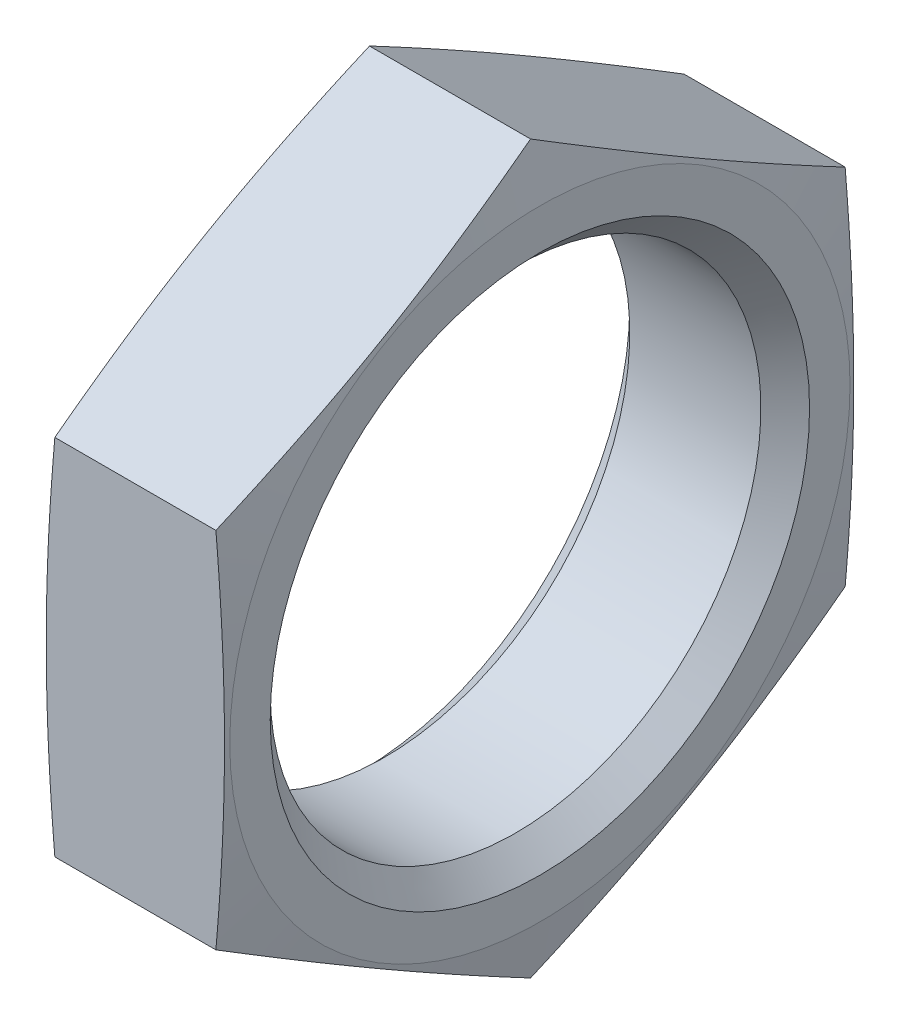
ISO-10303-21;
HEADER;
FILE_DESCRIPTION(('STEP AP214'),'2;1');
FILE_NAME('part.step','',(''),(''),'','','');
FILE_SCHEMA(('AUTOMOTIVE_DESIGN { 1 0 10303 214 1 1 1 1 }'));
ENDSEC;
DATA;
#1=APPLICATION_CONTEXT('core data for automotive mechanical design processes');
#2=APPLICATION_PROTOCOL_DEFINITION('international standard','automotive_design',2000,#1);
#3=PRODUCT_CONTEXT('',#1,'mechanical');
#4=PRODUCT('Part','Part','',(#3));
#5=PRODUCT_RELATED_PRODUCT_CATEGORY('part','',(#4));
#6=PRODUCT_DEFINITION_FORMATION('','',#4);
#7=PRODUCT_DEFINITION_CONTEXT('part definition',#1,'design');
#8=PRODUCT_DEFINITION('design','',#6,#7);
#9=PRODUCT_DEFINITION_SHAPE('','',#8);
#10=(LENGTH_UNIT() NAMED_UNIT(*) SI_UNIT(.MILLI.,.METRE.));
#11=(NAMED_UNIT(*) PLANE_ANGLE_UNIT() SI_UNIT($,.RADIAN.));
#12=(NAMED_UNIT(*) SI_UNIT($,.STERADIAN.) SOLID_ANGLE_UNIT());
#13=UNCERTAINTY_MEASURE_WITH_UNIT(LENGTH_MEASURE(1.E-05),#10,'distance_accuracy_value','');
#14=(GEOMETRIC_REPRESENTATION_CONTEXT(3) GLOBAL_UNCERTAINTY_ASSIGNED_CONTEXT((#13)) GLOBAL_UNIT_ASSIGNED_CONTEXT((#10,
#11,#12)) REPRESENTATION_CONTEXT('',''));
#15=CARTESIAN_POINT('',(0.,0.,0.));
#16=DIRECTION('',(0.,0.,1.));
#17=DIRECTION('',(1.,0.,0.));
#18=AXIS2_PLACEMENT_3D('',#15,#16,#17);
#19=CARTESIAN_POINT('',(0.,0.,0.));
#20=DIRECTION('',(1.,0.,0.));
#21=DIRECTION('',(0.,0.,-1.));
#22=AXIS2_PLACEMENT_3D('',#19,#20,#21);
#23=PLANE('',#22);
#24=CARTESIAN_POINT('',(0.,0.,0.));
#25=DIRECTION('',(-1.,0.,0.));
#26=DIRECTION('',(0.,0.,1.));
#27=AXIS2_PLACEMENT_3D('',#24,#25,#26);
#28=CIRCLE('',#27,6.);
#29=CARTESIAN_POINT('',(0.,0.,6.));
#30=VERTEX_POINT('',#29);
#31=EDGE_CURVE('E227',#30,#30,#28,.T.);
#32=ORIENTED_EDGE('',*,*,#31,.F.);
#33=EDGE_LOOP('',(#32));
#34=FACE_BOUND('',#33,.T.);
#35=CARTESIAN_POINT('',(0.,0.,0.));
#36=DIRECTION('',(-1.,0.,0.));
#37=DIRECTION('',(0.,0.,1.));
#38=AXIS2_PLACEMENT_3D('',#35,#36,#37);
#39=CIRCLE('',#38,6.9);
#40=CARTESIAN_POINT('',(0.,0.,6.9));
#41=VERTEX_POINT('',#40);
#42=EDGE_CURVE('E97',#41,#41,#39,.T.);
#43=ORIENTED_EDGE('',*,*,#42,.T.);
#44=EDGE_LOOP('',(#43));
#45=FACE_BOUND('',#44,.T.);
#46=ADVANCED_FACE('F38',(#34,#45),#23,.F.);
#47=CARTESIAN_POINT('',(0.51134824405455,0.,0.));
#48=DIRECTION('',(1.,0.,0.));
#49=DIRECTION('',(0.,0.,-1.));
#50=AXIS2_PLACEMENT_3D('',#47,#48,#49);
#51=CONICAL_SURFACE('',#50,9.8,1.39626340159546);
#52=CARTESIAN_POINT('',(0.208598210917811,-8.08301923870864,-0.000200000000000218));
#53=CARTESIAN_POINT('',(0.178934031185304,-7.91486089927859,0.291058787609258));
#54=CARTESIAN_POINT('',(0.152040963646026,-7.74656924527423,0.582548482834601));
#55=CARTESIAN_POINT('',(0.104836444466202,-7.40972818516162,1.165974313025));
#56=CARTESIAN_POINT('',(0.084526115902505,-7.24117873999497,1.45791051564118));
#57=CARTESIAN_POINT('',(0.051574332918035,-6.9042670406856,2.04145869650939));
#58=CARTESIAN_POINT('',(0.0389157604930656,-6.73590521607408,2.33306993079153));
#59=CARTESIAN_POINT('',(0.0219452806723447,-6.399088197368,2.91645412004434));
#60=CARTESIAN_POINT('',(0.0176326980708511,-6.23063301192955,3.20822706002217));
#61=CARTESIAN_POINT('',(0.0176326980708505,-5.89372264105265,3.79177293997783));
#62=CARTESIAN_POINT('',(0.0219452806723437,-5.7252674556142,4.08354587995566));
#63=CARTESIAN_POINT('',(0.0389157604930635,-5.38845043690812,4.66693006920846));
#64=CARTESIAN_POINT('',(0.0515743329180324,-5.22008861229661,4.95854130349061));
#65=CARTESIAN_POINT('',(0.0845261159025014,-4.88317691298723,5.54208948435882));
#66=CARTESIAN_POINT('',(0.104836444466198,-4.71462746782058,5.83402568697499));
#67=CARTESIAN_POINT('',(0.152040963646022,-4.37778640770797,6.4174515171654));
#68=CARTESIAN_POINT('',(0.178934031185299,-4.20949475370361,6.70894121239074));
#69=CARTESIAN_POINT('',(0.208598210917806,-4.04133641427356,7.0002));
#70=B_SPLINE_CURVE_WITH_KNOTS('',3,(#52,#53,#54,#55,#56,#57,#58,#59,#60,#61,#62,#63,#64,#65,#66,
#67,#68,#69),.UNSPECIFIED.,.F.,.F.,(4,2,2,2,2,2,2,2,4),(0.,1.01288904335959,2.02595080421072,
3.0367377405632,4.04744289899678,5.05814805743035,6.06893499378283,7.08199675463396,
8.09488579799355),.UNSPECIFIED.);
#71=CARTESIAN_POINT('',(0.208577849995566,-8.0829037686548,0.));
#72=VERTEX_POINT('',#71);
#73=CARTESIAN_POINT('',(0.208577849995561,-4.0414518843274,7.));
#74=VERTEX_POINT('',#73);
#75=EDGE_CURVE('E170',#72,#74,#70,.T.);
#76=ORIENTED_EDGE('',*,*,#75,.T.);
#77=CARTESIAN_POINT('',(1.03573983213423,-10.6852408917921,7.));
#78=CARTESIAN_POINT('',(0.988869445199721,-10.3673821120449,7.));
#79=CARTESIAN_POINT('',(0.942590712560512,-10.0494345856086,7.));
#80=CARTESIAN_POINT('',(0.851529569636411,-9.41331934046108,7.));
#81=CARTESIAN_POINT('',(0.806747188141204,-9.09515161763335,7.));
#82=CARTESIAN_POINT('',(0.718975002789949,-8.45843068087786,7.));
#83=CARTESIAN_POINT('',(0.675985966261113,-8.13987736074993,7.));
#84=CARTESIAN_POINT('',(0.592238427782165,-7.50247830410848,7.));
#85=CARTESIAN_POINT('',(0.551479917391049,-7.1836325687062,7.));
#86=CARTESIAN_POINT('',(0.472840896650842,-6.54666954301501,7.));
#87=CARTESIAN_POINT('',(0.43495118474371,-6.22855340024678,7.));
#88=CARTESIAN_POINT('',(0.362535904606859,-5.5919393220279,7.));
#89=CARTESIAN_POINT('',(0.328010370000629,-5.27344138279355,7.));
#90=CARTESIAN_POINT('',(0.230603111134978,-4.3173393176134,7.));
#91=CARTESIAN_POINT('',(0.173882882293425,-3.6790656290464,7.));
#92=CARTESIAN_POINT('',(0.106454465311887,-2.71889798061668,7.));
#93=CARTESIAN_POINT('',(0.0868952391638139,-2.39762281516337,7.));
#94=CARTESIAN_POINT('',(0.0546612740427168,-1.75472215713288,7.));
#95=CARTESIAN_POINT('',(0.0419864756511023,-1.43309666760329,7.));
#96=CARTESIAN_POINT('',(0.0241993730173904,-0.78969245575697,7.));
#97=CARTESIAN_POINT('',(0.0190856777128923,-0.467913772523749,7.));
#98=CARTESIAN_POINT('',(0.016717486441324,0.175673029012467,7.));
#99=CARTESIAN_POINT('',(0.0194629852335243,0.497481147295691,7.));
#100=CARTESIAN_POINT('',(0.0326600675426673,1.14144143877266,7.));
#101=CARTESIAN_POINT('',(0.0431237365163778,1.4635933594555,7.));
#102=CARTESIAN_POINT('',(0.0711886127627938,2.10758320342819,7.));
#103=CARTESIAN_POINT('',(0.0887898777304164,2.42942112415884,7.));
#104=CARTESIAN_POINT('',(0.130280498071933,3.07276879038696,7.));
#105=CARTESIAN_POINT('',(0.154171471801963,3.39427843001271,7.));
#106=CARTESIAN_POINT('',(0.207294286432592,4.03685079806428,7.));
#107=CARTESIAN_POINT('',(0.236526136299996,4.35791352573886,7.));
#108=CARTESIAN_POINT('',(0.327595241004518,5.28750846153191,7.));
#109=CARTESIAN_POINT('',(0.39515294255256,5.89547787340594,7.));
#110=CARTESIAN_POINT('',(0.540930761742126,7.11013733555543,7.));
#111=CARTESIAN_POINT('',(0.619151529712822,7.7168273055056,7.));
#112=CARTESIAN_POINT('',(0.782777339261565,8.92932590490273,7.));
#113=CARTESIAN_POINT('',(0.868183494686227,9.53513438284301,7.));
#114=CARTESIAN_POINT('',(1.04390039507952,10.7460167156099,7.));
#115=CARTESIAN_POINT('',(1.1342110042419,11.3510905903042,7.));
#116=CARTESIAN_POINT('',(1.31788327190217,12.5581361996854,7.));
#117=CARTESIAN_POINT('',(1.41123029581419,13.16011016982,7.));
#118=CARTESIAN_POINT('',(1.60038983250194,14.3636748668853,7.));
#119=CARTESIAN_POINT('',(1.69620236665469,14.9652655904468,7.));
#120=CARTESIAN_POINT('',(1.88958223615156,16.1677740331663,7.));
#121=CARTESIAN_POINT('',(1.98714842348572,16.7686919373405,7.));
#122=CARTESIAN_POINT('',(2.18367756873341,17.9702896857593,7.));
#123=CARTESIAN_POINT('',(2.28264050449119,18.570969533625,7.));
#124=CARTESIAN_POINT('',(2.38209492105432,19.1715669907708,7.));
#125=B_SPLINE_CURVE_WITH_KNOTS('',3,(#77,#78,#79,#80,#81,#82,#83,#84,#85,#86,#87,#88,#89,#90,
#91,#92,#93,#94,#95,#96,#97,#98,#99,#100,#101,#102,#103,#104,#105,#106,#107,#108,#109,#110,#111,
#112,#113,#114,#115,#116,#117,#118,#119,#120,#121,#122,#123,#124),.UNSPECIFIED.,.F.,.F.,(4,2,2,
2,2,2,2,2,2,2,2,2,2,2,2,2,2,2,2,2,2,2,2,4),(0.,0.963889255163711,1.92779704481883,
2.89211312249182,3.85642555064156,4.81750099011536,5.77858603413482,7.70057071049791,
8.66612092391068,9.63166280365416,10.5970270246378,11.5623906018898,12.5292690062345,
13.4961552262473,14.4632904718063,15.4304273411051,17.2653974812022,19.1004795843035,
20.9358466796179,22.7711629787824,24.5986616976693,26.4261762670786,28.2525351597174,
30.0788651144525),.UNSPECIFIED.);
#126=CARTESIAN_POINT('',(0.208577849995561,4.0414518843274,7.));
#127=VERTEX_POINT('',#126);
#128=EDGE_CURVE('E176',#74,#127,#125,.T.);
#129=ORIENTED_EDGE('',*,*,#128,.T.);
#130=CARTESIAN_POINT('',(0.208598210917806,4.04133641427356,7.0002));
#131=CARTESIAN_POINT('',(0.178934031185299,4.20949475370361,6.70894121239074));
#132=CARTESIAN_POINT('',(0.152040963646022,4.37778640770797,6.4174515171654));
#133=CARTESIAN_POINT('',(0.104836444466198,4.71462746782058,5.834025686975));
#134=CARTESIAN_POINT('',(0.0845261159025015,4.88317691298723,5.54208948435882));
#135=CARTESIAN_POINT('',(0.0515743329180325,5.2200886122966,4.95854130349061));
#136=CARTESIAN_POINT('',(0.0389157604930636,5.38845043690812,4.66693006920847));
#137=CARTESIAN_POINT('',(0.0219452806723438,5.7252674556142,4.08354587995566));
#138=CARTESIAN_POINT('',(0.0176326980708506,5.89372264105265,3.79177293997783));
#139=CARTESIAN_POINT('',(0.0176326980708511,6.23063301192955,3.20822706002217));
#140=CARTESIAN_POINT('',(0.0219452806723447,6.399088197368,2.91645412004434));
#141=CARTESIAN_POINT('',(0.0389157604930655,6.73590521607408,2.33306993079153));
#142=CARTESIAN_POINT('',(0.0515743329180349,6.9042670406856,2.04145869650939));
#143=CARTESIAN_POINT('',(0.0845261159025049,7.24117873999497,1.45791051564118));
#144=CARTESIAN_POINT('',(0.104836444466202,7.40972818516162,1.165974313025));
#145=CARTESIAN_POINT('',(0.152040963646026,7.74656924527423,0.582548482834602));
#146=CARTESIAN_POINT('',(0.178934031185304,7.91486089927859,0.291058787609259));
#147=CARTESIAN_POINT('',(0.208598210917811,8.08301923870864,-0.000199999999999923));
#148=B_SPLINE_CURVE_WITH_KNOTS('',3,(#130,#131,#132,#133,#134,#135,#136,#137,#138,#139,#140,
#141,#142,#143,#144,#145,#146,#147),.UNSPECIFIED.,.F.,.F.,(4,2,2,2,2,2,2,2,4),(0.,
1.01288904335959,2.02595080421072,3.03673774056321,4.04744289899678,5.05814805743035,
6.06893499378283,7.08199675463396,8.09488579799355),.UNSPECIFIED.);
#149=CARTESIAN_POINT('',(0.208577849995566,8.0829037686548,0.));
#150=VERTEX_POINT('',#149);
#151=EDGE_CURVE('E146',#127,#150,#148,.T.);
#152=ORIENTED_EDGE('',*,*,#151,.T.);
#153=CARTESIAN_POINT('',(0.208598210917811,8.08301923870864,0.000200000000000218));
#154=CARTESIAN_POINT('',(0.178934031185304,7.91486089927859,-0.291058787609258));
#155=CARTESIAN_POINT('',(0.152040963646026,7.74656924527423,-0.582548482834601));
#156=CARTESIAN_POINT('',(0.104836444466202,7.40972818516162,-1.165974313025));
#157=CARTESIAN_POINT('',(0.084526115902505,7.24117873999497,-1.45791051564118));
#158=CARTESIAN_POINT('',(0.051574332918035,6.9042670406856,-2.04145869650939));
#159=CARTESIAN_POINT('',(0.0389157604930656,6.73590521607408,-2.33306993079153));
#160=CARTESIAN_POINT('',(0.0219452806723447,6.399088197368,-2.91645412004434));
#161=CARTESIAN_POINT('',(0.0176326980708511,6.23063301192955,-3.20822706002217));
#162=CARTESIAN_POINT('',(0.0176326980708505,5.89372264105265,-3.79177293997783));
#163=CARTESIAN_POINT('',(0.0219452806723437,5.7252674556142,-4.08354587995566));
#164=CARTESIAN_POINT('',(0.0389157604930635,5.38845043690812,-4.66693006920846));
#165=CARTESIAN_POINT('',(0.0515743329180324,5.22008861229661,-4.95854130349061));
#166=CARTESIAN_POINT('',(0.0845261159025014,4.88317691298723,-5.54208948435882));
#167=CARTESIAN_POINT('',(0.104836444466198,4.71462746782058,-5.83402568697499));
#168=CARTESIAN_POINT('',(0.152040963646022,4.37778640770797,-6.4174515171654));
#169=CARTESIAN_POINT('',(0.178934031185299,4.20949475370361,-6.70894121239074));
#170=CARTESIAN_POINT('',(0.208598210917806,4.04133641427356,-7.0002));
#171=B_SPLINE_CURVE_WITH_KNOTS('',3,(#153,#154,#155,#156,#157,#158,#159,#160,#161,#162,#163,
#164,#165,#166,#167,#168,#169,#170),.UNSPECIFIED.,.F.,.F.,(4,2,2,2,2,2,2,2,4),(0.,
1.01288904335959,2.02595080421072,3.0367377405632,4.04744289899678,5.05814805743035,
6.06893499378283,7.08199675463396,8.09488579799355),.UNSPECIFIED.);
#172=CARTESIAN_POINT('',(0.208577849995561,4.0414518843274,-7.));
#173=VERTEX_POINT('',#172);
#174=EDGE_CURVE('E104',#150,#173,#171,.T.);
#175=ORIENTED_EDGE('',*,*,#174,.T.);
#176=CARTESIAN_POINT('',(1.03573983213423,-10.6852408917921,-7.));
#177=CARTESIAN_POINT('',(0.988869445199721,-10.3673821120449,-7.));
#178=CARTESIAN_POINT('',(0.942590712560512,-10.0494345856086,-7.));
#179=CARTESIAN_POINT('',(0.851529569636411,-9.41331934046108,-7.));
#180=CARTESIAN_POINT('',(0.806747188141204,-9.09515161763335,-7.));
#181=CARTESIAN_POINT('',(0.718975002789949,-8.45843068087786,-7.));
#182=CARTESIAN_POINT('',(0.675985966261113,-8.13987736074993,-7.));
#183=CARTESIAN_POINT('',(0.592238427782165,-7.50247830410848,-7.));
#184=CARTESIAN_POINT('',(0.551479917391049,-7.1836325687062,-7.));
#185=CARTESIAN_POINT('',(0.472840896650842,-6.54666954301501,-7.));
#186=CARTESIAN_POINT('',(0.43495118474371,-6.22855340024678,-7.));
#187=CARTESIAN_POINT('',(0.362535904606859,-5.5919393220279,-7.));
#188=CARTESIAN_POINT('',(0.328010370000629,-5.27344138279355,-7.));
#189=CARTESIAN_POINT('',(0.230603111134978,-4.3173393176134,-7.));
#190=CARTESIAN_POINT('',(0.173882882293425,-3.6790656290464,-7.));
#191=CARTESIAN_POINT('',(0.106454465311887,-2.71889798061668,-7.));
#192=CARTESIAN_POINT('',(0.0868952391638139,-2.39762281516337,-7.));
#193=CARTESIAN_POINT('',(0.0546612740427168,-1.75472215713288,-7.));
#194=CARTESIAN_POINT('',(0.0419864756511023,-1.43309666760329,-7.));
#195=CARTESIAN_POINT('',(0.0241993730173904,-0.78969245575697,-7.));
#196=CARTESIAN_POINT('',(0.0190856777128923,-0.467913772523749,-7.));
#197=CARTESIAN_POINT('',(0.016717486441324,0.175673029012467,-7.));
#198=CARTESIAN_POINT('',(0.0194629852335243,0.497481147295691,-7.));
#199=CARTESIAN_POINT('',(0.0326600675426673,1.14144143877266,-7.));
#200=CARTESIAN_POINT('',(0.0431237365163778,1.4635933594555,-7.));
#201=CARTESIAN_POINT('',(0.0711886127627938,2.10758320342819,-7.));
#202=CARTESIAN_POINT('',(0.0887898777304164,2.42942112415884,-7.));
#203=CARTESIAN_POINT('',(0.130280498071933,3.07276879038696,-7.));
#204=CARTESIAN_POINT('',(0.154171471801963,3.39427843001271,-7.));
#205=CARTESIAN_POINT('',(0.207294286432592,4.03685079806428,-7.));
#206=CARTESIAN_POINT('',(0.236526136299996,4.35791352573886,-7.));
#207=CARTESIAN_POINT('',(0.327595241004518,5.28750846153191,-7.));
#208=CARTESIAN_POINT('',(0.39515294255256,5.89547787340594,-7.));
#209=CARTESIAN_POINT('',(0.540930761742126,7.11013733555543,-7.));
#210=CARTESIAN_POINT('',(0.619151529712822,7.7168273055056,-7.));
#211=CARTESIAN_POINT('',(0.782777339261565,8.92932590490273,-7.));
#212=CARTESIAN_POINT('',(0.868183494686227,9.53513438284301,-7.));
#213=CARTESIAN_POINT('',(1.04390039507952,10.7460167156099,-7.));
#214=CARTESIAN_POINT('',(1.1342110042419,11.3510905903042,-7.));
#215=CARTESIAN_POINT('',(1.31788327190217,12.5581361996854,-7.));
#216=CARTESIAN_POINT('',(1.41123029581419,13.16011016982,-7.));
#217=CARTESIAN_POINT('',(1.60038983250194,14.3636748668853,-7.));
#218=CARTESIAN_POINT('',(1.69620236665469,14.9652655904468,-7.));
#219=CARTESIAN_POINT('',(1.88958223615156,16.1677740331663,-7.));
#220=CARTESIAN_POINT('',(1.98714842348572,16.7686919373405,-7.));
#221=CARTESIAN_POINT('',(2.18367756873341,17.9702896857593,-7.));
#222=CARTESIAN_POINT('',(2.28264050449119,18.570969533625,-7.));
#223=CARTESIAN_POINT('',(2.38209492105432,19.1715669907708,-7.));
#224=B_SPLINE_CURVE_WITH_KNOTS('',3,(#176,#177,#178,#179,#180,#181,#182,#183,#184,#185,#186,
#187,#188,#189,#190,#191,#192,#193,#194,#195,#196,#197,#198,#199,#200,#201,#202,#203,#204,#205,
#206,#207,#208,#209,#210,#211,#212,#213,#214,#215,#216,#217,#218,#219,#220,#221,#222,#223),
.UNSPECIFIED.,.F.,.F.,(4,2,2,2,2,2,2,2,2,2,2,2,2,2,2,2,2,2,2,2,2,2,2,4),(0.,0.963889255163711,
1.92779704481883,2.89211312249182,3.85642555064156,4.81750099011536,5.77858603413482,
7.70057071049791,8.66612092391068,9.63166280365416,10.5970270246378,11.5623906018898,
12.5292690062345,13.4961552262473,14.4632904718063,15.4304273411051,17.2653974812022,
19.1004795843035,20.9358466796179,22.7711629787824,24.5986616976693,26.4261762670786,
28.2525351597174,30.0788651144525),.UNSPECIFIED.);
#225=CARTESIAN_POINT('',(0.208577849995561,-4.0414518843274,-7.));
#226=VERTEX_POINT('',#225);
#227=EDGE_CURVE('E145',#173,#226,#224,.F.);
#228=ORIENTED_EDGE('',*,*,#227,.T.);
#229=CARTESIAN_POINT('',(0.208598210917806,-4.04133641427356,-7.0002));
#230=CARTESIAN_POINT('',(0.178934031185299,-4.20949475370361,-6.70894121239074));
#231=CARTESIAN_POINT('',(0.152040963646022,-4.37778640770797,-6.4174515171654));
#232=CARTESIAN_POINT('',(0.104836444466198,-4.71462746782058,-5.834025686975));
#233=CARTESIAN_POINT('',(0.0845261159025015,-4.88317691298723,-5.54208948435882));
#234=CARTESIAN_POINT('',(0.0515743329180325,-5.2200886122966,-4.95854130349061));
#235=CARTESIAN_POINT('',(0.0389157604930636,-5.38845043690812,-4.66693006920847));
#236=CARTESIAN_POINT('',(0.0219452806723438,-5.7252674556142,-4.08354587995566));
#237=CARTESIAN_POINT('',(0.0176326980708506,-5.89372264105265,-3.79177293997783));
#238=CARTESIAN_POINT('',(0.0176326980708511,-6.23063301192955,-3.20822706002217));
#239=CARTESIAN_POINT('',(0.0219452806723447,-6.399088197368,-2.91645412004434));
#240=CARTESIAN_POINT('',(0.0389157604930655,-6.73590521607408,-2.33306993079153));
#241=CARTESIAN_POINT('',(0.0515743329180349,-6.9042670406856,-2.04145869650939));
#242=CARTESIAN_POINT('',(0.0845261159025049,-7.24117873999497,-1.45791051564118));
#243=CARTESIAN_POINT('',(0.104836444466202,-7.40972818516162,-1.165974313025));
#244=CARTESIAN_POINT('',(0.152040963646026,-7.74656924527423,-0.582548482834602));
#245=CARTESIAN_POINT('',(0.178934031185304,-7.91486089927859,-0.291058787609259));
#246=CARTESIAN_POINT('',(0.208598210917811,-8.08301923870864,0.000199999999999923));
#247=B_SPLINE_CURVE_WITH_KNOTS('',3,(#229,#230,#231,#232,#233,#234,#235,#236,#237,#238,#239,
#240,#241,#242,#243,#244,#245,#246),.UNSPECIFIED.,.F.,.F.,(4,2,2,2,2,2,2,2,4),(0.,
1.01288904335959,2.02595080421072,3.03673774056321,4.04744289899678,5.05814805743035,
6.06893499378283,7.08199675463396,8.09488579799355),.UNSPECIFIED.);
#248=EDGE_CURVE('E165',#226,#72,#247,.T.);
#249=ORIENTED_EDGE('',*,*,#248,.T.);
#250=EDGE_LOOP('',(#76,#129,#152,#175,#228,#249));
#251=FACE_BOUND('',#250,.T.);
#252=ORIENTED_EDGE('',*,*,#42,.F.);
#253=EDGE_LOOP('',(#252));
#254=FACE_BOUND('',#253,.T.);
#255=ADVANCED_FACE('F155',(#251,#254),#51,.T.);
#256=CARTESIAN_POINT('',(4.,0.,0.));
#257=DIRECTION('',(-1.,0.,0.));
#258=DIRECTION('',(0.,0.,1.));
#259=AXIS2_PLACEMENT_3D('',#256,#257,#258);
#260=CONICAL_SURFACE('',#259,6.9,1.39626340159548);
#261=CARTESIAN_POINT('',(3.79140178908221,8.08301923870864,-0.000200000000000054));
#262=CARTESIAN_POINT('',(3.82106596881471,7.91486089927859,0.291058787609259));
#263=CARTESIAN_POINT('',(3.84795903635399,7.74656924527423,0.582548482834602));
#264=CARTESIAN_POINT('',(3.89516355553381,7.40972818516162,1.16597431302501));
#265=CARTESIAN_POINT('',(3.9154738840975,7.24117873999497,1.45791051564118));
#266=CARTESIAN_POINT('',(3.94842566708197,6.9042670406856,2.04145869650939));
#267=CARTESIAN_POINT('',(3.96108423950694,6.73590521607408,2.33306993079154));
#268=CARTESIAN_POINT('',(3.97805471932766,6.399088197368,2.91645412004434));
#269=CARTESIAN_POINT('',(3.98236730192915,6.23063301192955,3.20822706002217));
#270=CARTESIAN_POINT('',(3.98236730192915,5.89372264105265,3.79177293997783));
#271=CARTESIAN_POINT('',(3.97805471932766,5.7252674556142,4.08354587995566));
#272=CARTESIAN_POINT('',(3.96108423950694,5.38845043690812,4.66693006920847));
#273=CARTESIAN_POINT('',(3.94842566708197,5.2200886122966,4.95854130349061));
#274=CARTESIAN_POINT('',(3.91547388409751,4.88317691298723,5.54208948435882));
#275=CARTESIAN_POINT('',(3.89516355553381,4.71462746782058,5.834025686975));
#276=CARTESIAN_POINT('',(3.84795903635399,4.37778640770797,6.4174515171654));
#277=CARTESIAN_POINT('',(3.82106596881472,4.20949475370361,6.70894121239074));
#278=CARTESIAN_POINT('',(3.79140178908221,4.04133641427356,7.0002));
#279=B_SPLINE_CURVE_WITH_KNOTS('',3,(#261,#262,#263,#264,#265,#266,#267,#268,#269,#270,#271,
#272,#273,#274,#275,#276,#277,#278),.UNSPECIFIED.,.F.,.F.,(4,2,2,2,2,2,2,2,4),(0.,
1.01288904335959,2.02595080421072,3.03673774056321,4.04744289899678,5.05814805743035,
6.06893499378283,7.08199675463396,8.09488579799355),.UNSPECIFIED.);
#280=CARTESIAN_POINT('',(3.79142215000445,8.0829037686548,0.));
#281=VERTEX_POINT('',#280);
#282=CARTESIAN_POINT('',(3.79142215000446,4.0414518843274,7.));
#283=VERTEX_POINT('',#282);
#284=EDGE_CURVE('E92',#281,#283,#279,.T.);
#285=ORIENTED_EDGE('',*,*,#284,.T.);
#286=CARTESIAN_POINT('',(2.96426016786588,-10.6852408917921,7.));
#287=CARTESIAN_POINT('',(3.01113055480038,-10.3673821120449,7.));
#288=CARTESIAN_POINT('',(3.05740928743958,-10.0494345856086,7.));
#289=CARTESIAN_POINT('',(3.14847043036367,-9.41331934046108,7.));
#290=CARTESIAN_POINT('',(3.19325281185887,-9.09515161763334,7.));
#291=CARTESIAN_POINT('',(3.28102499721012,-8.45843068087785,7.));
#292=CARTESIAN_POINT('',(3.32401403373895,-8.13987736074992,7.));
#293=CARTESIAN_POINT('',(3.40776157221789,-7.50247830410848,7.));
#294=CARTESIAN_POINT('',(3.44852008260901,-7.1836325687062,7.));
#295=CARTESIAN_POINT('',(3.5271591033492,-6.54666954301501,7.));
#296=CARTESIAN_POINT('',(3.56504881525633,-6.22855340024678,7.));
#297=CARTESIAN_POINT('',(3.63746409539318,-5.5919393220279,7.));
#298=CARTESIAN_POINT('',(3.6719896299994,-5.27344138279355,7.));
#299=CARTESIAN_POINT('',(3.76939688886504,-4.3173393176134,7.));
#300=CARTESIAN_POINT('',(3.82611711770659,-3.6790656290464,7.));
#301=CARTESIAN_POINT('',(3.89354553468812,-2.71889798061667,7.));
#302=CARTESIAN_POINT('',(3.9131047608362,-2.39762281516337,7.));
#303=CARTESIAN_POINT('',(3.94533872595729,-1.75472215713288,7.));
#304=CARTESIAN_POINT('',(3.9580135243489,-1.43309666760329,7.));
#305=CARTESIAN_POINT('',(3.97580062698261,-0.789692455756971,7.));
#306=CARTESIAN_POINT('',(3.98091432228711,-0.46791377252375,7.));
#307=CARTESIAN_POINT('',(3.98328251355868,0.175673029012464,7.));
#308=CARTESIAN_POINT('',(3.98053701476648,0.497481147295686,7.));
#309=CARTESIAN_POINT('',(3.96733993245734,1.14144143877265,7.));
#310=CARTESIAN_POINT('',(3.95687626348363,1.46359335945549,7.));
#311=CARTESIAN_POINT('',(3.92881138723721,2.10758320342818,7.));
#312=CARTESIAN_POINT('',(3.91121012226959,2.42942112415883,7.));
#313=CARTESIAN_POINT('',(3.86971950192808,3.07276879038695,7.));
#314=CARTESIAN_POINT('',(3.84582852819805,3.3942784300127,7.));
#315=CARTESIAN_POINT('',(3.79270571356743,4.03685079806426,7.));
#316=CARTESIAN_POINT('',(3.76347386370003,4.35791352573884,7.));
#317=CARTESIAN_POINT('',(3.67240475899552,5.2875084615319,7.));
#318=CARTESIAN_POINT('',(3.60484705744748,5.89547787340592,7.));
#319=CARTESIAN_POINT('',(3.45906923825793,7.11013733555542,7.));
#320=CARTESIAN_POINT('',(3.38084847028724,7.71682730550558,7.));
#321=CARTESIAN_POINT('',(3.21722266073851,8.92932590490272,7.));
#322=CARTESIAN_POINT('',(3.13181650531386,9.535134382843,7.));
#323=CARTESIAN_POINT('',(2.95609960492058,10.7460167156099,7.));
#324=CARTESIAN_POINT('',(2.86578899575821,11.3510905903042,7.));
#325=CARTESIAN_POINT('',(2.68211672809796,12.5581361996853,7.));
#326=CARTESIAN_POINT('',(2.58876970418595,13.16011016982,7.));
#327=CARTESIAN_POINT('',(2.39961016749821,14.3636748668853,7.));
#328=CARTESIAN_POINT('',(2.30379763334547,14.9652655904467,7.));
#329=CARTESIAN_POINT('',(2.11041776384863,16.1677740331663,7.));
#330=CARTESIAN_POINT('',(2.01285157651448,16.7686919373405,7.));
#331=CARTESIAN_POINT('',(1.81632243126681,17.9702896857593,7.));
#332=CARTESIAN_POINT('',(1.71735949550903,18.570969533625,7.));
#333=CARTESIAN_POINT('',(1.61790507894591,19.1715669907708,7.));
#334=B_SPLINE_CURVE_WITH_KNOTS('',3,(#286,#287,#288,#289,#290,#291,#292,#293,#294,#295,#296,
#297,#298,#299,#300,#301,#302,#303,#304,#305,#306,#307,#308,#309,#310,#311,#312,#313,#314,#315,
#316,#317,#318,#319,#320,#321,#322,#323,#324,#325,#326,#327,#328,#329,#330,#331,#332,#333),
.UNSPECIFIED.,.F.,.F.,(4,2,2,2,2,2,2,2,2,2,2,2,2,2,2,2,2,2,2,2,2,2,2,4),(0.,0.963889255163708,
1.92779704481883,2.89211312249182,3.85642555064155,4.81750099011535,5.7785860341348,
7.70057071049789,8.66612092391066,9.63166280365414,10.5970270246378,11.5623906018898,
12.5292690062345,13.4961552262472,14.4632904718063,15.4304273411051,17.2653974812022,
19.1004795843035,20.9358466796178,22.7711629787823,24.5986616976692,26.4261762670786,
28.2525351597173,30.0788651144525),.UNSPECIFIED.);
#335=CARTESIAN_POINT('',(3.79142215000446,-4.0414518843274,7.));
#336=VERTEX_POINT('',#335);
#337=EDGE_CURVE('E11',#283,#336,#334,.F.);
#338=ORIENTED_EDGE('',*,*,#337,.T.);
#339=CARTESIAN_POINT('',(3.79140178908221,-4.04133641427356,7.0002));
#340=CARTESIAN_POINT('',(3.82106596881472,-4.20949475370361,6.70894121239074));
#341=CARTESIAN_POINT('',(3.84795903635399,-4.37778640770797,6.4174515171654));
#342=CARTESIAN_POINT('',(3.89516355553381,-4.71462746782058,5.83402568697499));
#343=CARTESIAN_POINT('',(3.91547388409751,-4.88317691298723,5.54208948435882));
#344=CARTESIAN_POINT('',(3.94842566708197,-5.22008861229661,4.95854130349061));
#345=CARTESIAN_POINT('',(3.96108423950694,-5.38845043690812,4.66693006920846));
#346=CARTESIAN_POINT('',(3.97805471932766,-5.7252674556142,4.08354587995566));
#347=CARTESIAN_POINT('',(3.98236730192915,-5.89372264105265,3.79177293997783));
#348=CARTESIAN_POINT('',(3.98236730192915,-6.23063301192955,3.20822706002217));
#349=CARTESIAN_POINT('',(3.97805471932766,-6.399088197368,2.91645412004434));
#350=CARTESIAN_POINT('',(3.96108423950694,-6.73590521607408,2.33306993079153));
#351=CARTESIAN_POINT('',(3.94842566708197,-6.9042670406856,2.04145869650939));
#352=CARTESIAN_POINT('',(3.9154738840975,-7.24117873999497,1.45791051564118));
#353=CARTESIAN_POINT('',(3.89516355553381,-7.40972818516162,1.165974313025));
#354=CARTESIAN_POINT('',(3.84795903635399,-7.74656924527423,0.582548482834601));
#355=CARTESIAN_POINT('',(3.82106596881471,-7.91486089927859,0.291058787609258));
#356=CARTESIAN_POINT('',(3.79140178908221,-8.08301923870864,-0.00020000000000161));
#357=B_SPLINE_CURVE_WITH_KNOTS('',3,(#339,#340,#341,#342,#343,#344,#345,#346,#347,#348,#349,
#350,#351,#352,#353,#354,#355,#356),.UNSPECIFIED.,.F.,.F.,(4,2,2,2,2,2,2,2,4),(0.,
1.01288904335959,2.02595080421072,3.03673774056321,4.04744289899678,5.05814805743035,
6.06893499378283,7.08199675463396,8.09488579799355),.UNSPECIFIED.);
#358=CARTESIAN_POINT('',(3.79142215000445,-8.0829037686548,0.));
#359=VERTEX_POINT('',#358);
#360=EDGE_CURVE('E50',#336,#359,#357,.T.);
#361=ORIENTED_EDGE('',*,*,#360,.T.);
#362=CARTESIAN_POINT('',(3.79140178908221,-8.08301923870864,0.000200000000000054));
#363=CARTESIAN_POINT('',(3.82106596881471,-7.91486089927859,-0.291058787609259));
#364=CARTESIAN_POINT('',(3.84795903635399,-7.74656924527423,-0.582548482834602));
#365=CARTESIAN_POINT('',(3.89516355553381,-7.40972818516162,-1.16597431302501));
#366=CARTESIAN_POINT('',(3.9154738840975,-7.24117873999497,-1.45791051564118));
#367=CARTESIAN_POINT('',(3.94842566708197,-6.9042670406856,-2.04145869650939));
#368=CARTESIAN_POINT('',(3.96108423950694,-6.73590521607408,-2.33306993079154));
#369=CARTESIAN_POINT('',(3.97805471932766,-6.399088197368,-2.91645412004434));
#370=CARTESIAN_POINT('',(3.98236730192915,-6.23063301192955,-3.20822706002217));
#371=CARTESIAN_POINT('',(3.98236730192915,-5.89372264105265,-3.79177293997783));
#372=CARTESIAN_POINT('',(3.97805471932766,-5.7252674556142,-4.08354587995566));
#373=CARTESIAN_POINT('',(3.96108423950694,-5.38845043690812,-4.66693006920847));
#374=CARTESIAN_POINT('',(3.94842566708197,-5.2200886122966,-4.95854130349061));
#375=CARTESIAN_POINT('',(3.91547388409751,-4.88317691298723,-5.54208948435882));
#376=CARTESIAN_POINT('',(3.89516355553381,-4.71462746782058,-5.834025686975));
#377=CARTESIAN_POINT('',(3.84795903635399,-4.37778640770797,-6.4174515171654));
#378=CARTESIAN_POINT('',(3.82106596881472,-4.20949475370361,-6.70894121239074));
#379=CARTESIAN_POINT('',(3.79140178908221,-4.04133641427356,-7.0002));
#380=B_SPLINE_CURVE_WITH_KNOTS('',3,(#362,#363,#364,#365,#366,#367,#368,#369,#370,#371,#372,
#373,#374,#375,#376,#377,#378,#379),.UNSPECIFIED.,.F.,.F.,(4,2,2,2,2,2,2,2,4),(0.,
1.01288904335959,2.02595080421072,3.03673774056321,4.04744289899678,5.05814805743035,
6.06893499378283,7.08199675463396,8.09488579799355),.UNSPECIFIED.);
#381=CARTESIAN_POINT('',(3.79142215000446,-4.0414518843274,-7.));
#382=VERTEX_POINT('',#381);
#383=EDGE_CURVE('E114',#359,#382,#380,.T.);
#384=ORIENTED_EDGE('',*,*,#383,.T.);
#385=CARTESIAN_POINT('',(2.96426016786588,-10.6852408917921,-7.));
#386=CARTESIAN_POINT('',(3.01113055480038,-10.3673821120449,-7.));
#387=CARTESIAN_POINT('',(3.05740928743958,-10.0494345856086,-7.));
#388=CARTESIAN_POINT('',(3.14847043036367,-9.41331934046108,-7.));
#389=CARTESIAN_POINT('',(3.19325281185887,-9.09515161763334,-7.));
#390=CARTESIAN_POINT('',(3.28102499721012,-8.45843068087785,-7.));
#391=CARTESIAN_POINT('',(3.32401403373895,-8.13987736074992,-7.));
#392=CARTESIAN_POINT('',(3.40776157221789,-7.50247830410848,-7.));
#393=CARTESIAN_POINT('',(3.44852008260901,-7.1836325687062,-7.));
#394=CARTESIAN_POINT('',(3.5271591033492,-6.54666954301501,-7.));
#395=CARTESIAN_POINT('',(3.56504881525633,-6.22855340024678,-7.));
#396=CARTESIAN_POINT('',(3.63746409539318,-5.5919393220279,-7.));
#397=CARTESIAN_POINT('',(3.6719896299994,-5.27344138279355,-7.));
#398=CARTESIAN_POINT('',(3.76939688886504,-4.3173393176134,-7.));
#399=CARTESIAN_POINT('',(3.82611711770659,-3.6790656290464,-7.));
#400=CARTESIAN_POINT('',(3.89354553468812,-2.71889798061667,-7.));
#401=CARTESIAN_POINT('',(3.9131047608362,-2.39762281516337,-7.));
#402=CARTESIAN_POINT('',(3.94533872595729,-1.75472215713288,-7.));
#403=CARTESIAN_POINT('',(3.9580135243489,-1.43309666760329,-7.));
#404=CARTESIAN_POINT('',(3.97580062698261,-0.789692455756971,-7.));
#405=CARTESIAN_POINT('',(3.98091432228711,-0.46791377252375,-7.));
#406=CARTESIAN_POINT('',(3.98328251355868,0.175673029012464,-7.));
#407=CARTESIAN_POINT('',(3.98053701476648,0.497481147295686,-7.));
#408=CARTESIAN_POINT('',(3.96733993245734,1.14144143877265,-7.));
#409=CARTESIAN_POINT('',(3.95687626348363,1.46359335945549,-7.));
#410=CARTESIAN_POINT('',(3.92881138723721,2.10758320342818,-7.));
#411=CARTESIAN_POINT('',(3.91121012226959,2.42942112415883,-7.));
#412=CARTESIAN_POINT('',(3.86971950192808,3.07276879038695,-7.));
#413=CARTESIAN_POINT('',(3.84582852819805,3.3942784300127,-7.));
#414=CARTESIAN_POINT('',(3.79270571356743,4.03685079806426,-7.));
#415=CARTESIAN_POINT('',(3.76347386370003,4.35791352573884,-7.));
#416=CARTESIAN_POINT('',(3.67240475899552,5.2875084615319,-7.));
#417=CARTESIAN_POINT('',(3.60484705744748,5.89547787340592,-7.));
#418=CARTESIAN_POINT('',(3.45906923825793,7.11013733555542,-7.));
#419=CARTESIAN_POINT('',(3.38084847028724,7.71682730550558,-7.));
#420=CARTESIAN_POINT('',(3.21722266073851,8.92932590490272,-7.));
#421=CARTESIAN_POINT('',(3.13181650531386,9.535134382843,-7.));
#422=CARTESIAN_POINT('',(2.95609960492058,10.7460167156099,-7.));
#423=CARTESIAN_POINT('',(2.86578899575821,11.3510905903042,-7.));
#424=CARTESIAN_POINT('',(2.68211672809796,12.5581361996853,-7.));
#425=CARTESIAN_POINT('',(2.58876970418595,13.16011016982,-7.));
#426=CARTESIAN_POINT('',(2.39961016749821,14.3636748668853,-7.));
#427=CARTESIAN_POINT('',(2.30379763334547,14.9652655904467,-7.));
#428=CARTESIAN_POINT('',(2.11041776384863,16.1677740331663,-7.));
#429=CARTESIAN_POINT('',(2.01285157651448,16.7686919373405,-7.));
#430=CARTESIAN_POINT('',(1.81632243126681,17.9702896857593,-7.));
#431=CARTESIAN_POINT('',(1.71735949550903,18.570969533625,-7.));
#432=CARTESIAN_POINT('',(1.61790507894591,19.1715669907708,-7.));
#433=B_SPLINE_CURVE_WITH_KNOTS('',3,(#385,#386,#387,#388,#389,#390,#391,#392,#393,#394,#395,
#396,#397,#398,#399,#400,#401,#402,#403,#404,#405,#406,#407,#408,#409,#410,#411,#412,#413,#414,
#415,#416,#417,#418,#419,#420,#421,#422,#423,#424,#425,#426,#427,#428,#429,#430,#431,#432),
.UNSPECIFIED.,.F.,.F.,(4,2,2,2,2,2,2,2,2,2,2,2,2,2,2,2,2,2,2,2,2,2,2,4),(0.,0.963889255163708,
1.92779704481883,2.89211312249182,3.85642555064155,4.81750099011535,5.7785860341348,
7.70057071049789,8.66612092391066,9.63166280365414,10.5970270246378,11.5623906018898,
12.5292690062345,13.4961552262472,14.4632904718063,15.4304273411051,17.2653974812022,
19.1004795843035,20.9358466796178,22.7711629787823,24.5986616976692,26.4261762670786,
28.2525351597173,30.0788651144525),.UNSPECIFIED.);
#434=CARTESIAN_POINT('',(3.79142215000446,4.0414518843274,-7.));
#435=VERTEX_POINT('',#434);
#436=EDGE_CURVE('E112',#382,#435,#433,.T.);
#437=ORIENTED_EDGE('',*,*,#436,.T.);
#438=CARTESIAN_POINT('',(3.79140178908221,4.04133641427356,-7.0002));
#439=CARTESIAN_POINT('',(3.82106596881472,4.20949475370361,-6.70894121239074));
#440=CARTESIAN_POINT('',(3.84795903635399,4.37778640770797,-6.4174515171654));
#441=CARTESIAN_POINT('',(3.89516355553381,4.71462746782058,-5.83402568697499));
#442=CARTESIAN_POINT('',(3.91547388409751,4.88317691298723,-5.54208948435882));
#443=CARTESIAN_POINT('',(3.94842566708197,5.22008861229661,-4.95854130349061));
#444=CARTESIAN_POINT('',(3.96108423950694,5.38845043690812,-4.66693006920846));
#445=CARTESIAN_POINT('',(3.97805471932766,5.7252674556142,-4.08354587995566));
#446=CARTESIAN_POINT('',(3.98236730192915,5.89372264105265,-3.79177293997783));
#447=CARTESIAN_POINT('',(3.98236730192915,6.23063301192955,-3.20822706002217));
#448=CARTESIAN_POINT('',(3.97805471932766,6.399088197368,-2.91645412004434));
#449=CARTESIAN_POINT('',(3.96108423950694,6.73590521607408,-2.33306993079153));
#450=CARTESIAN_POINT('',(3.94842566708197,6.9042670406856,-2.04145869650939));
#451=CARTESIAN_POINT('',(3.9154738840975,7.24117873999497,-1.45791051564118));
#452=CARTESIAN_POINT('',(3.89516355553381,7.40972818516162,-1.165974313025));
#453=CARTESIAN_POINT('',(3.84795903635399,7.74656924527423,-0.582548482834601));
#454=CARTESIAN_POINT('',(3.82106596881471,7.91486089927859,-0.291058787609258));
#455=CARTESIAN_POINT('',(3.79140178908221,8.08301923870864,0.00020000000000161));
#456=B_SPLINE_CURVE_WITH_KNOTS('',3,(#438,#439,#440,#441,#442,#443,#444,#445,#446,#447,#448,
#449,#450,#451,#452,#453,#454,#455),.UNSPECIFIED.,.F.,.F.,(4,2,2,2,2,2,2,2,4),(0.,
1.01288904335959,2.02595080421072,3.03673774056321,4.04744289899678,5.05814805743035,
6.06893499378283,7.08199675463396,8.09488579799355),.UNSPECIFIED.);
#457=EDGE_CURVE('E96',#435,#281,#456,.T.);
#458=ORIENTED_EDGE('',*,*,#457,.T.);
#459=EDGE_LOOP('',(#285,#338,#361,#384,#437,#458));
#460=FACE_BOUND('',#459,.T.);
#461=CARTESIAN_POINT('',(4.,0.,0.));
#462=DIRECTION('',(-1.,0.,0.));
#463=DIRECTION('',(0.,0.,1.));
#464=AXIS2_PLACEMENT_3D('',#461,#462,#463);
#465=CIRCLE('',#464,6.9);
#466=CARTESIAN_POINT('',(4.,0.,6.9));
#467=VERTEX_POINT('',#466);
#468=EDGE_CURVE('E230',#467,#467,#465,.T.);
#469=ORIENTED_EDGE('',*,*,#468,.T.);
#470=EDGE_LOOP('',(#469));
#471=FACE_BOUND('',#470,.T.);
#472=ADVANCED_FACE('F109',(#460,#471),#260,.T.);
#473=CARTESIAN_POINT('',(4.,6.9,0.));
#474=DIRECTION('',(-1.,0.,0.));
#475=DIRECTION('',(0.,0.,1.));
#476=AXIS2_PLACEMENT_3D('',#473,#474,#475);
#477=PLANE('',#476);
#478=CARTESIAN_POINT('',(4.,0.,0.));
#479=DIRECTION('',(-1.,0.,0.));
#480=DIRECTION('',(0.,0.,1.));
#481=AXIS2_PLACEMENT_3D('',#478,#479,#480);
#482=CIRCLE('',#481,6.);
#483=CARTESIAN_POINT('',(4.,0.,6.));
#484=VERTEX_POINT('',#483);
#485=EDGE_CURVE('E216',#484,#484,#482,.T.);
#486=ORIENTED_EDGE('',*,*,#485,.T.);
#487=EDGE_LOOP('',(#486));
#488=FACE_BOUND('',#487,.T.);
#489=ORIENTED_EDGE('',*,*,#468,.F.);
#490=EDGE_LOOP('',(#489));
#491=FACE_BOUND('',#490,.T.);
#492=ADVANCED_FACE('F245',(#488,#491),#477,.F.);
#493=CARTESIAN_POINT('',(0.5415,0.,0.));
#494=DIRECTION('',(-1.,0.,0.));
#495=DIRECTION('',(0.,0.,1.));
#496=AXIS2_PLACEMENT_3D('',#493,#494,#495);
#497=CONICAL_SURFACE('',#496,5.4585,0.785398163397449);
#498=ORIENTED_EDGE('',*,*,#31,.T.);
#499=EDGE_LOOP('',(#498));
#500=FACE_BOUND('',#499,.T.);
#501=CARTESIAN_POINT('',(0.5415,0.,0.));
#502=DIRECTION('',(-1.,0.,0.));
#503=DIRECTION('',(0.,0.,1.));
#504=AXIS2_PLACEMENT_3D('',#501,#502,#503);
#505=CIRCLE('',#504,5.4585);
#506=CARTESIAN_POINT('',(0.5415,0.,5.4585));
#507=VERTEX_POINT('',#506);
#508=EDGE_CURVE('E222',#507,#507,#505,.T.);
#509=ORIENTED_EDGE('',*,*,#508,.F.);
#510=EDGE_LOOP('',(#509));
#511=FACE_BOUND('',#510,.T.);
#512=ADVANCED_FACE('F241',(#500,#511),#497,.F.);
#513=CARTESIAN_POINT('',(4.,0.,0.));
#514=DIRECTION('',(-1.,0.,0.));
#515=DIRECTION('',(0.,0.,1.));
#516=AXIS2_PLACEMENT_3D('',#513,#514,#515);
#517=CYLINDRICAL_SURFACE('',#516,5.4585);
#518=ORIENTED_EDGE('',*,*,#508,.T.);
#519=EDGE_LOOP('',(#518));
#520=FACE_BOUND('',#519,.T.);
#521=CARTESIAN_POINT('',(3.4585,0.,0.));
#522=DIRECTION('',(-1.,0.,0.));
#523=DIRECTION('',(0.,0.,1.));
#524=AXIS2_PLACEMENT_3D('',#521,#522,#523);
#525=CIRCLE('',#524,5.4585);
#526=CARTESIAN_POINT('',(3.4585,0.,5.4585));
#527=VERTEX_POINT('',#526);
#528=EDGE_CURVE('E218',#527,#527,#525,.T.);
#529=ORIENTED_EDGE('',*,*,#528,.F.);
#530=EDGE_LOOP('',(#529));
#531=FACE_BOUND('',#530,.T.);
#532=ADVANCED_FACE('F244',(#520,#531),#517,.F.);
#533=CARTESIAN_POINT('',(4.,0.,0.));
#534=DIRECTION('',(1.,0.,0.));
#535=DIRECTION('',(0.,0.,-1.));
#536=AXIS2_PLACEMENT_3D('',#533,#534,#535);
#537=CONICAL_SURFACE('',#536,6.,0.785398163397448);
#538=ORIENTED_EDGE('',*,*,#528,.T.);
#539=EDGE_LOOP('',(#538));
#540=FACE_BOUND('',#539,.T.);
#541=ORIENTED_EDGE('',*,*,#485,.F.);
#542=EDGE_LOOP('',(#541));
#543=FACE_BOUND('',#542,.T.);
#544=ADVANCED_FACE('F251',(#540,#543),#537,.F.);
#545=CARTESIAN_POINT('',(4.,4.0414518843274,7.));
#546=DIRECTION('',(0.,0.,-1.));
#547=DIRECTION('',(-1.,0.,0.));
#548=AXIS2_PLACEMENT_3D('',#545,#546,#547);
#549=PLANE('',#548);
#550=DIRECTION('',(-1.,0.,0.));
#551=VECTOR('',#550,1.);
#552=CARTESIAN_POINT('',(4.,-4.0414518843274,7.));
#553=LINE('',#552,#551);
#554=EDGE_CURVE('E208',#336,#74,#553,.T.);
#555=ORIENTED_EDGE('',*,*,#554,.F.);
#556=ORIENTED_EDGE('',*,*,#337,.F.);
#557=DIRECTION('',(-1.,0.,0.));
#558=VECTOR('',#557,1.);
#559=CARTESIAN_POINT('',(4.,4.0414518843274,7.));
#560=LINE('',#559,#558);
#561=EDGE_CURVE('E62',#283,#127,#560,.T.);
#562=ORIENTED_EDGE('',*,*,#561,.T.);
#563=ORIENTED_EDGE('',*,*,#128,.F.);
#564=EDGE_LOOP('',(#555,#556,#562,#563));
#565=FACE_BOUND('',#564,.T.);
#566=ADVANCED_FACE('F185',(#565),#549,.F.);
#567=CARTESIAN_POINT('',(4.,-4.0414518843274,7.));
#568=DIRECTION('',(0.,0.866025403784438,-0.500000000000002));
#569=DIRECTION('',(0.,0.500000000000002,0.866025403784438));
#570=AXIS2_PLACEMENT_3D('',#567,#568,#569);
#571=PLANE('',#570);
#572=DIRECTION('',(-1.,0.,0.));
#573=VECTOR('',#572,1.);
#574=CARTESIAN_POINT('',(4.,-8.0829037686548,0.));
#575=LINE('',#574,#573);
#576=EDGE_CURVE('E202',#359,#72,#575,.T.);
#577=ORIENTED_EDGE('',*,*,#576,.F.);
#578=ORIENTED_EDGE('',*,*,#360,.F.);
#579=ORIENTED_EDGE('',*,*,#554,.T.);
#580=ORIENTED_EDGE('',*,*,#75,.F.);
#581=EDGE_LOOP('',(#577,#578,#579,#580));
#582=FACE_BOUND('',#581,.T.);
#583=ADVANCED_FACE('F181',(#582),#571,.F.);
#584=CARTESIAN_POINT('',(4.,-8.0829037686548,0.));
#585=DIRECTION('',(0.,0.866025403784438,0.500000000000002));
#586=DIRECTION('',(0.,-0.500000000000002,0.866025403784438));
#587=AXIS2_PLACEMENT_3D('',#584,#585,#586);
#588=PLANE('',#587);
#589=DIRECTION('',(-1.,0.,0.));
#590=VECTOR('',#589,1.);
#591=CARTESIAN_POINT('',(4.,-4.0414518843274,-7.));
#592=LINE('',#591,#590);
#593=EDGE_CURVE('E205',#382,#226,#592,.T.);
#594=ORIENTED_EDGE('',*,*,#593,.F.);
#595=ORIENTED_EDGE('',*,*,#383,.F.);
#596=ORIENTED_EDGE('',*,*,#576,.T.);
#597=ORIENTED_EDGE('',*,*,#248,.F.);
#598=EDGE_LOOP('',(#594,#595,#596,#597));
#599=FACE_BOUND('',#598,.T.);
#600=ADVANCED_FACE('F184',(#599),#588,.F.);
#601=CARTESIAN_POINT('',(4.,-4.0414518843274,-7.));
#602=DIRECTION('',(0.,0.,1.));
#603=DIRECTION('',(1.,0.,0.));
#604=AXIS2_PLACEMENT_3D('',#601,#602,#603);
#605=PLANE('',#604);
#606=DIRECTION('',(-1.,0.,0.));
#607=VECTOR('',#606,1.);
#608=CARTESIAN_POINT('',(4.,4.0414518843274,-7.));
#609=LINE('',#608,#607);
#610=EDGE_CURVE('E106',#435,#173,#609,.T.);
#611=ORIENTED_EDGE('',*,*,#610,.F.);
#612=ORIENTED_EDGE('',*,*,#436,.F.);
#613=ORIENTED_EDGE('',*,*,#593,.T.);
#614=ORIENTED_EDGE('',*,*,#227,.F.);
#615=EDGE_LOOP('',(#611,#612,#613,#614));
#616=FACE_BOUND('',#615,.T.);
#617=ADVANCED_FACE('F134',(#616),#605,.F.);
#618=CARTESIAN_POINT('',(4.,4.0414518843274,-7.));
#619=DIRECTION('',(0.,-0.866025403784438,0.500000000000002));
#620=DIRECTION('',(0.,-0.500000000000002,-0.866025403784438));
#621=AXIS2_PLACEMENT_3D('',#618,#619,#620);
#622=PLANE('',#621);
#623=DIRECTION('',(-1.,0.,0.));
#624=VECTOR('',#623,1.);
#625=CARTESIAN_POINT('',(4.,8.0829037686548,0.));
#626=LINE('',#625,#624);
#627=EDGE_CURVE('E57',#281,#150,#626,.T.);
#628=ORIENTED_EDGE('',*,*,#627,.F.);
#629=ORIENTED_EDGE('',*,*,#457,.F.);
#630=ORIENTED_EDGE('',*,*,#610,.T.);
#631=ORIENTED_EDGE('',*,*,#174,.F.);
#632=EDGE_LOOP('',(#628,#629,#630,#631));
#633=FACE_BOUND('',#632,.T.);
#634=ADVANCED_FACE('F100',(#633),#622,.F.);
#635=CARTESIAN_POINT('',(4.,8.0829037686548,0.));
#636=DIRECTION('',(0.,-0.866025403784438,-0.500000000000002));
#637=DIRECTION('',(0.,0.500000000000002,-0.866025403784438));
#638=AXIS2_PLACEMENT_3D('',#635,#636,#637);
#639=PLANE('',#638);
#640=ORIENTED_EDGE('',*,*,#561,.F.);
#641=ORIENTED_EDGE('',*,*,#284,.F.);
#642=ORIENTED_EDGE('',*,*,#627,.T.);
#643=ORIENTED_EDGE('',*,*,#151,.F.);
#644=EDGE_LOOP('',(#640,#641,#642,#643));
#645=FACE_BOUND('',#644,.T.);
#646=ADVANCED_FACE('F93',(#645),#639,.F.);
#647=CLOSED_SHELL('',(#46,#255,#472,#492,#512,#532,#544,#566,#583,#600,#617,#634,#646));
#648=MANIFOLD_SOLID_BREP('B2',#647);
#649=ADVANCED_BREP_SHAPE_REPRESENTATION('',(#18,#648),#14);
#650=SHAPE_DEFINITION_REPRESENTATION(#9,#649);
ENDSEC;
END-ISO-10303-21;
